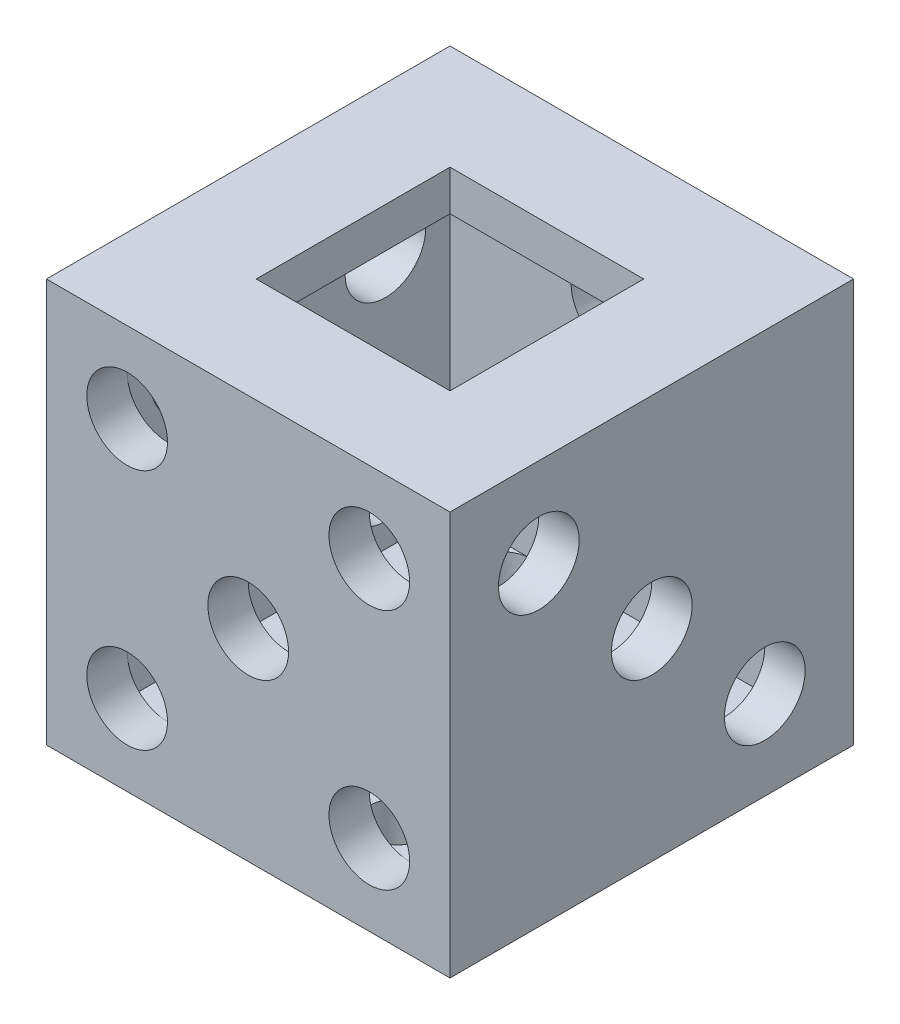
ISO-10303-21;
HEADER;
FILE_DESCRIPTION(('STEP AP214'),'2;1');
FILE_NAME('part.step','',(''),(''),'','','');
FILE_SCHEMA(('AUTOMOTIVE_DESIGN { 1 0 10303 214 1 1 1 1 }'));
ENDSEC;
DATA;
#1=APPLICATION_CONTEXT('core data for automotive mechanical design processes');
#2=APPLICATION_PROTOCOL_DEFINITION('international standard','automotive_design',2000,#1);
#3=PRODUCT_CONTEXT('',#1,'mechanical');
#4=PRODUCT('Part','Part','',(#3));
#5=PRODUCT_RELATED_PRODUCT_CATEGORY('part','',(#4));
#6=PRODUCT_DEFINITION_FORMATION('','',#4);
#7=PRODUCT_DEFINITION_CONTEXT('part definition',#1,'design');
#8=PRODUCT_DEFINITION('design','',#6,#7);
#9=PRODUCT_DEFINITION_SHAPE('','',#8);
#10=(LENGTH_UNIT() NAMED_UNIT(*) SI_UNIT(.MILLI.,.METRE.));
#11=(NAMED_UNIT(*) PLANE_ANGLE_UNIT() SI_UNIT($,.RADIAN.));
#12=(NAMED_UNIT(*) SI_UNIT($,.STERADIAN.) SOLID_ANGLE_UNIT());
#13=UNCERTAINTY_MEASURE_WITH_UNIT(LENGTH_MEASURE(1.E-05),#10,'distance_accuracy_value','');
#14=(GEOMETRIC_REPRESENTATION_CONTEXT(3) GLOBAL_UNCERTAINTY_ASSIGNED_CONTEXT((#13)) GLOBAL_UNIT_ASSIGNED_CONTEXT((#10,
#11,#12)) REPRESENTATION_CONTEXT('',''));
#15=CARTESIAN_POINT('',(0.,0.,0.));
#16=DIRECTION('',(0.,0.,1.));
#17=DIRECTION('',(1.,0.,0.));
#18=AXIS2_PLACEMENT_3D('',#15,#16,#17);
#19=CARTESIAN_POINT('',(-12.5,25.,10.));
#20=DIRECTION('',(0.,0.,-1.));
#21=DIRECTION('',(-1.,0.,0.));
#22=AXIS2_PLACEMENT_3D('',#19,#20,#21);
#23=PLANE('',#22);
#24=CARTESIAN_POINT('',(7.5,5.,10.));
#25=DIRECTION('',(0.,0.,-1.));
#26=DIRECTION('',(-1.,0.,0.));
#27=AXIS2_PLACEMENT_3D('',#24,#25,#26);
#28=CIRCLE('',#27,2.5);
#29=CARTESIAN_POINT('',(10.,5.,10.));
#30=VERTEX_POINT('',#29);
#31=CARTESIAN_POINT('',(7.5,2.5,10.));
#32=VERTEX_POINT('',#31);
#33=EDGE_CURVE('E348',#30,#32,#28,.T.);
#34=ORIENTED_EDGE('',*,*,#33,.F.);
#35=DIRECTION('',(0.,-1.,0.));
#36=VECTOR('',#35,1.);
#37=CARTESIAN_POINT('',(10.,25.,10.));
#38=LINE('',#37,#36);
#39=CARTESIAN_POINT('',(10.,2.5,10.));
#40=VERTEX_POINT('',#39);
#41=EDGE_CURVE('E247',#30,#40,#38,.T.);
#42=ORIENTED_EDGE('',*,*,#41,.T.);
#43=DIRECTION('',(1.,0.,0.));
#44=VECTOR('',#43,1.);
#45=CARTESIAN_POINT('',(-12.5,2.5,10.));
#46=LINE('',#45,#44);
#47=EDGE_CURVE('E223',#32,#40,#46,.T.);
#48=ORIENTED_EDGE('',*,*,#47,.F.);
#49=EDGE_LOOP('',(#34,#42,#48));
#50=FACE_BOUND('',#49,.T.);
#51=ADVANCED_FACE('F39',(#50),#23,.T.);
#52=EDGE_CURVE('E351',#32,#30,#28,.T.);
#53=ORIENTED_EDGE('',*,*,#52,.F.);
#54=CARTESIAN_POINT('',(5.,2.5,10.));
#55=VERTEX_POINT('',#54);
#56=EDGE_CURVE('E639',#55,#32,#46,.T.);
#57=ORIENTED_EDGE('',*,*,#56,.F.);
#58=CARTESIAN_POINT('',(-5.,2.5,10.));
#59=VERTEX_POINT('',#58);
#60=EDGE_CURVE('E224',#59,#55,#46,.T.);
#61=ORIENTED_EDGE('',*,*,#60,.F.);
#62=CARTESIAN_POINT('',(-7.5,2.5,10.));
#63=VERTEX_POINT('',#62);
#64=EDGE_CURVE('E199',#63,#59,#46,.T.);
#65=ORIENTED_EDGE('',*,*,#64,.F.);
#66=CARTESIAN_POINT('',(-7.5,5.,10.));
#67=DIRECTION('',(0.,0.,-1.));
#68=DIRECTION('',(-1.,0.,0.));
#69=AXIS2_PLACEMENT_3D('',#66,#67,#68);
#70=CIRCLE('',#69,2.5);
#71=CARTESIAN_POINT('',(-10.,5.,10.));
#72=VERTEX_POINT('',#71);
#73=EDGE_CURVE('E182',#72,#63,#70,.T.);
#74=ORIENTED_EDGE('',*,*,#73,.F.);
#75=DIRECTION('',(0.,-1.,0.));
#76=VECTOR('',#75,1.);
#77=CARTESIAN_POINT('',(-10.,25.,10.));
#78=LINE('',#77,#76);
#79=CARTESIAN_POINT('',(-10.,20.,10.));
#80=VERTEX_POINT('',#79);
#81=EDGE_CURVE('E196',#80,#72,#78,.T.);
#82=ORIENTED_EDGE('',*,*,#81,.F.);
#83=CARTESIAN_POINT('',(-7.5,20.,10.));
#84=DIRECTION('',(0.,0.,-1.));
#85=DIRECTION('',(-1.,0.,0.));
#86=AXIS2_PLACEMENT_3D('',#83,#84,#85);
#87=CIRCLE('',#86,2.5);
#88=CARTESIAN_POINT('',(-7.5,22.5,10.));
#89=VERTEX_POINT('',#88);
#90=EDGE_CURVE('E202',#89,#80,#87,.T.);
#91=ORIENTED_EDGE('',*,*,#90,.F.);
#92=DIRECTION('',(1.,0.,0.));
#93=VECTOR('',#92,1.);
#94=CARTESIAN_POINT('',(-12.5,22.5,10.));
#95=LINE('',#94,#93);
#96=CARTESIAN_POINT('',(7.5,22.5,10.));
#97=VERTEX_POINT('',#96);
#98=EDGE_CURVE('E510',#89,#97,#95,.T.);
#99=ORIENTED_EDGE('',*,*,#98,.T.);
#100=CARTESIAN_POINT('',(7.5,20.,10.));
#101=DIRECTION('',(0.,0.,-1.));
#102=DIRECTION('',(-1.,0.,0.));
#103=AXIS2_PLACEMENT_3D('',#100,#101,#102);
#104=CIRCLE('',#103,2.5);
#105=CARTESIAN_POINT('',(10.,20.,10.));
#106=VERTEX_POINT('',#105);
#107=EDGE_CURVE('E546',#106,#97,#104,.T.);
#108=ORIENTED_EDGE('',*,*,#107,.F.);
#109=EDGE_CURVE('E246',#106,#30,#38,.T.);
#110=ORIENTED_EDGE('',*,*,#109,.T.);
#111=EDGE_LOOP('',(#53,#57,#61,#65,#74,#82,#91,#99,#108,#110));
#112=FACE_BOUND('',#111,.T.);
#113=CARTESIAN_POINT('',(0.,12.5,10.));
#114=DIRECTION('',(0.,0.,-1.));
#115=DIRECTION('',(-1.,0.,0.));
#116=AXIS2_PLACEMENT_3D('',#113,#114,#115);
#117=CIRCLE('',#116,2.5);
#118=CARTESIAN_POINT('',(-2.5,12.5,10.));
#119=VERTEX_POINT('',#118);
#120=EDGE_CURVE('E617',#119,#119,#117,.T.);
#121=ORIENTED_EDGE('',*,*,#120,.F.);
#122=EDGE_LOOP('',(#121));
#123=FACE_BOUND('',#122,.T.);
#124=ADVANCED_FACE('F193',(#112,#123),#23,.T.);
#125=EDGE_CURVE('E63',#80,#89,#87,.T.);
#126=ORIENTED_EDGE('',*,*,#125,.F.);
#127=CARTESIAN_POINT('',(-10.,22.5,10.));
#128=VERTEX_POINT('',#127);
#129=EDGE_CURVE('E211',#128,#80,#78,.T.);
#130=ORIENTED_EDGE('',*,*,#129,.F.);
#131=EDGE_CURVE('E258',#128,#89,#95,.T.);
#132=ORIENTED_EDGE('',*,*,#131,.T.);
#133=EDGE_LOOP('',(#126,#130,#132));
#134=FACE_BOUND('',#133,.T.);
#135=ADVANCED_FACE('F602',(#134),#23,.T.);
#136=EDGE_CURVE('E56',#97,#106,#104,.T.);
#137=ORIENTED_EDGE('',*,*,#136,.F.);
#138=CARTESIAN_POINT('',(10.,22.5,10.));
#139=VERTEX_POINT('',#138);
#140=EDGE_CURVE('E511',#97,#139,#95,.T.);
#141=ORIENTED_EDGE('',*,*,#140,.T.);
#142=EDGE_CURVE('E242',#139,#106,#38,.T.);
#143=ORIENTED_EDGE('',*,*,#142,.T.);
#144=EDGE_LOOP('',(#137,#141,#143));
#145=FACE_BOUND('',#144,.T.);
#146=ADVANCED_FACE('F605',(#145),#23,.T.);
#147=CARTESIAN_POINT('',(10.,25.,-12.5));
#148=DIRECTION('',(-1.,0.,0.));
#149=DIRECTION('',(0.,0.,1.));
#150=AXIS2_PLACEMENT_3D('',#147,#148,#149);
#151=PLANE('',#150);
#152=ORIENTED_EDGE('',*,*,#41,.F.);
#153=ORIENTED_EDGE('',*,*,#109,.F.);
#154=ORIENTED_EDGE('',*,*,#142,.F.);
#155=DIRECTION('',(0.,0.,-1.));
#156=VECTOR('',#155,1.);
#157=CARTESIAN_POINT('',(10.,22.5,-12.5));
#158=LINE('',#157,#156);
#159=CARTESIAN_POINT('',(10.,22.5,-10.));
#160=VERTEX_POINT('',#159);
#161=EDGE_CURVE('E217',#139,#160,#158,.T.);
#162=ORIENTED_EDGE('',*,*,#161,.T.);
#163=DIRECTION('',(0.,-1.,0.));
#164=VECTOR('',#163,1.);
#165=CARTESIAN_POINT('',(10.,25.,-10.));
#166=LINE('',#165,#164);
#167=CARTESIAN_POINT('',(10.,2.5,-10.));
#168=VERTEX_POINT('',#167);
#169=EDGE_CURVE('E232',#160,#168,#166,.T.);
#170=ORIENTED_EDGE('',*,*,#169,.T.);
#171=DIRECTION('',(0.,0.,-1.));
#172=VECTOR('',#171,1.);
#173=CARTESIAN_POINT('',(10.,2.5,-12.5));
#174=LINE('',#173,#172);
#175=EDGE_CURVE('E248',#40,#168,#174,.T.);
#176=ORIENTED_EDGE('',*,*,#175,.F.);
#177=EDGE_LOOP('',(#152,#153,#154,#162,#170,#176));
#178=FACE_BOUND('',#177,.T.);
#179=CARTESIAN_POINT('',(10.,19.5,7.));
#180=DIRECTION('',(-1.,0.,0.));
#181=DIRECTION('',(0.,0.,1.));
#182=AXIS2_PLACEMENT_3D('',#179,#180,#181);
#183=CIRCLE('',#182,2.5);
#184=CARTESIAN_POINT('',(10.,19.5,9.5));
#185=VERTEX_POINT('',#184);
#186=EDGE_CURVE('E389',#185,#185,#183,.T.);
#187=ORIENTED_EDGE('',*,*,#186,.F.);
#188=EDGE_LOOP('',(#187));
#189=FACE_BOUND('',#188,.T.);
#190=CARTESIAN_POINT('',(10.,12.5,0.));
#191=DIRECTION('',(-1.,0.,0.));
#192=DIRECTION('',(0.,0.,1.));
#193=AXIS2_PLACEMENT_3D('',#190,#191,#192);
#194=CIRCLE('',#193,2.5);
#195=CARTESIAN_POINT('',(10.,12.5,2.5));
#196=VERTEX_POINT('',#195);
#197=EDGE_CURVE('E381',#196,#196,#194,.T.);
#198=ORIENTED_EDGE('',*,*,#197,.F.);
#199=EDGE_LOOP('',(#198));
#200=FACE_BOUND('',#199,.T.);
#201=CARTESIAN_POINT('',(10.,5.5,-7.));
#202=DIRECTION('',(-1.,0.,0.));
#203=DIRECTION('',(0.,0.,1.));
#204=AXIS2_PLACEMENT_3D('',#201,#202,#203);
#205=CIRCLE('',#204,2.5);
#206=CARTESIAN_POINT('',(10.,5.5,-4.5));
#207=VERTEX_POINT('',#206);
#208=EDGE_CURVE('E374',#207,#207,#205,.T.);
#209=ORIENTED_EDGE('',*,*,#208,.F.);
#210=EDGE_LOOP('',(#209));
#211=FACE_BOUND('',#210,.T.);
#212=ADVANCED_FACE('F525',(#178,#189,#200,#211),#151,.T.);
#213=CARTESIAN_POINT('',(-12.5,25.,-10.));
#214=DIRECTION('',(0.,0.,1.));
#215=DIRECTION('',(1.,0.,0.));
#216=AXIS2_PLACEMENT_3D('',#213,#214,#215);
#217=PLANE('',#216);
#218=CARTESIAN_POINT('',(0.,18.5,-10.));
#219=DIRECTION('',(0.,0.,1.));
#220=DIRECTION('',(1.,0.,0.));
#221=AXIS2_PLACEMENT_3D('',#218,#219,#220);
#222=CIRCLE('',#221,2.5);
#223=CARTESIAN_POINT('',(2.5,18.5,-10.));
#224=VERTEX_POINT('',#223);
#225=EDGE_CURVE('E695',#224,#224,#222,.T.);
#226=ORIENTED_EDGE('',*,*,#225,.F.);
#227=EDGE_LOOP('',(#226));
#228=FACE_BOUND('',#227,.T.);
#229=CARTESIAN_POINT('',(0.,6.5,-10.));
#230=DIRECTION('',(0.,0.,1.));
#231=DIRECTION('',(1.,0.,0.));
#232=AXIS2_PLACEMENT_3D('',#229,#230,#231);
#233=CIRCLE('',#232,2.5);
#234=CARTESIAN_POINT('',(2.5,6.5,-10.));
#235=VERTEX_POINT('',#234);
#236=EDGE_CURVE('E703',#235,#235,#233,.T.);
#237=ORIENTED_EDGE('',*,*,#236,.F.);
#238=EDGE_LOOP('',(#237));
#239=FACE_BOUND('',#238,.T.);
#240=DIRECTION('',(-1.,0.,0.));
#241=VECTOR('',#240,1.);
#242=CARTESIAN_POINT('',(-12.5,2.5,-10.));
#243=LINE('',#242,#241);
#244=CARTESIAN_POINT('',(-5.,2.5,-10.));
#245=VERTEX_POINT('',#244);
#246=CARTESIAN_POINT('',(-10.,2.5,-10.));
#247=VERTEX_POINT('',#246);
#248=EDGE_CURVE('E241',#245,#247,#243,.T.);
#249=ORIENTED_EDGE('',*,*,#248,.F.);
#250=CARTESIAN_POINT('',(5.,2.5,-10.));
#251=VERTEX_POINT('',#250);
#252=EDGE_CURVE('E240',#251,#245,#243,.T.);
#253=ORIENTED_EDGE('',*,*,#252,.F.);
#254=EDGE_CURVE('E236',#168,#251,#243,.T.);
#255=ORIENTED_EDGE('',*,*,#254,.F.);
#256=ORIENTED_EDGE('',*,*,#169,.F.);
#257=DIRECTION('',(-1.,0.,0.));
#258=VECTOR('',#257,1.);
#259=CARTESIAN_POINT('',(-12.5,22.5,-10.));
#260=LINE('',#259,#258);
#261=CARTESIAN_POINT('',(-10.,22.5,-10.));
#262=VERTEX_POINT('',#261);
#263=EDGE_CURVE('E514',#160,#262,#260,.T.);
#264=ORIENTED_EDGE('',*,*,#263,.T.);
#265=DIRECTION('',(0.,-1.,0.));
#266=VECTOR('',#265,1.);
#267=CARTESIAN_POINT('',(-10.,25.,-10.));
#268=LINE('',#267,#266);
#269=EDGE_CURVE('E225',#262,#247,#268,.T.);
#270=ORIENTED_EDGE('',*,*,#269,.T.);
#271=EDGE_LOOP('',(#249,#253,#255,#256,#264,#270));
#272=FACE_BOUND('',#271,.T.);
#273=ADVANCED_FACE('F322',(#228,#239,#272),#217,.T.);
#274=CARTESIAN_POINT('',(-10.,25.,-12.5));
#275=DIRECTION('',(1.,0.,0.));
#276=DIRECTION('',(0.,0.,-1.));
#277=AXIS2_PLACEMENT_3D('',#274,#275,#276);
#278=PLANE('',#277);
#279=CARTESIAN_POINT('',(-10.,6.5,6.));
#280=DIRECTION('',(1.,0.,0.));
#281=DIRECTION('',(0.,0.,-1.));
#282=AXIS2_PLACEMENT_3D('',#279,#280,#281);
#283=CIRCLE('',#282,2.5);
#284=CARTESIAN_POINT('',(-10.,5.,4.));
#285=VERTEX_POINT('',#284);
#286=CARTESIAN_POINT('',(-10.,5.,8.00000000000001));
#287=VERTEX_POINT('',#286);
#288=EDGE_CURVE('E329',#285,#287,#283,.T.);
#289=ORIENTED_EDGE('',*,*,#288,.F.);
#290=CARTESIAN_POINT('',(-10.,6.5,6.));
#291=DIRECTION('',(1.,0.,0.));
#292=DIRECTION('',(0.,-0.599999999999999,0.800000000000001));
#293=AXIS2_PLACEMENT_3D('',#290,#291,#292);
#294=CIRCLE('',#293,2.5);
#295=EDGE_CURVE('E269',#287,#285,#294,.T.);
#296=ORIENTED_EDGE('',*,*,#295,.F.);
#297=EDGE_LOOP('',(#289,#296));
#298=FACE_BOUND('',#297,.T.);
#299=ORIENTED_EDGE('',*,*,#81,.T.);
#300=CARTESIAN_POINT('',(-10.,2.5,10.));
#301=VERTEX_POINT('',#300);
#302=EDGE_CURVE('E203',#72,#301,#78,.T.);
#303=ORIENTED_EDGE('',*,*,#302,.T.);
#304=DIRECTION('',(0.,0.,1.));
#305=VECTOR('',#304,1.);
#306=CARTESIAN_POINT('',(-10.,2.5,-12.5));
#307=LINE('',#306,#305);
#308=EDGE_CURVE('E229',#247,#301,#307,.T.);
#309=ORIENTED_EDGE('',*,*,#308,.F.);
#310=ORIENTED_EDGE('',*,*,#269,.F.);
#311=DIRECTION('',(0.,0.,1.));
#312=VECTOR('',#311,1.);
#313=CARTESIAN_POINT('',(-10.,22.5,-12.5));
#314=LINE('',#313,#312);
#315=EDGE_CURVE('E512',#262,#128,#314,.T.);
#316=ORIENTED_EDGE('',*,*,#315,.T.);
#317=ORIENTED_EDGE('',*,*,#129,.T.);
#318=EDGE_LOOP('',(#299,#303,#309,#310,#316,#317));
#319=FACE_BOUND('',#318,.T.);
#320=CARTESIAN_POINT('',(-10.,18.5,6.));
#321=DIRECTION('',(1.,0.,0.));
#322=DIRECTION('',(0.,0.600000000000001,-0.799999999999999));
#323=AXIS2_PLACEMENT_3D('',#320,#321,#322);
#324=CIRCLE('',#323,2.5);
#325=CARTESIAN_POINT('',(-10.,20.,4.00000000000001));
#326=VERTEX_POINT('',#325);
#327=CARTESIAN_POINT('',(-10.,20.,8.));
#328=VERTEX_POINT('',#327);
#329=EDGE_CURVE('E308',#326,#328,#324,.T.);
#330=ORIENTED_EDGE('',*,*,#329,.F.);
#331=CARTESIAN_POINT('',(-10.,18.5,6.));
#332=DIRECTION('',(1.,0.,0.));
#333=DIRECTION('',(0.,0.,-1.));
#334=AXIS2_PLACEMENT_3D('',#331,#332,#333);
#335=CIRCLE('',#334,2.5);
#336=EDGE_CURVE('E312',#328,#326,#335,.T.);
#337=ORIENTED_EDGE('',*,*,#336,.F.);
#338=EDGE_LOOP('',(#330,#337));
#339=FACE_BOUND('',#338,.T.);
#340=CARTESIAN_POINT('',(-10.,6.5,-6.));
#341=DIRECTION('',(1.,0.,0.));
#342=DIRECTION('',(0.,0.,-1.));
#343=AXIS2_PLACEMENT_3D('',#340,#341,#342);
#344=CIRCLE('',#343,2.5);
#345=CARTESIAN_POINT('',(-10.,6.5,-8.5));
#346=VERTEX_POINT('',#345);
#347=EDGE_CURVE('E340',#346,#346,#344,.T.);
#348=ORIENTED_EDGE('',*,*,#347,.F.);
#349=EDGE_LOOP('',(#348));
#350=FACE_BOUND('',#349,.T.);
#351=CARTESIAN_POINT('',(-10.,18.5,-6.));
#352=DIRECTION('',(1.,0.,0.));
#353=DIRECTION('',(0.,0.,-1.));
#354=AXIS2_PLACEMENT_3D('',#351,#352,#353);
#355=CIRCLE('',#354,2.5);
#356=CARTESIAN_POINT('',(-10.,18.5,-8.5));
#357=VERTEX_POINT('',#356);
#358=EDGE_CURVE('E365',#357,#357,#355,.T.);
#359=ORIENTED_EDGE('',*,*,#358,.F.);
#360=EDGE_LOOP('',(#359));
#361=FACE_BOUND('',#360,.T.);
#362=ADVANCED_FACE('F212',(#298,#319,#339,#350,#361),#278,.T.);
#363=EDGE_CURVE('E178',#63,#72,#70,.T.);
#364=ORIENTED_EDGE('',*,*,#363,.F.);
#365=EDGE_CURVE('E205',#301,#63,#46,.T.);
#366=ORIENTED_EDGE('',*,*,#365,.F.);
#367=ORIENTED_EDGE('',*,*,#302,.F.);
#368=EDGE_LOOP('',(#364,#366,#367));
#369=FACE_BOUND('',#368,.T.);
#370=ADVANCED_FACE('F204',(#369),#23,.T.);
#371=CARTESIAN_POINT('',(0.,22.5,0.));
#372=DIRECTION('',(0.,1.,0.));
#373=DIRECTION('',(0.,0.,1.));
#374=AXIS2_PLACEMENT_3D('',#371,#372,#373);
#375=PLANE('',#374);
#376=ORIENTED_EDGE('',*,*,#98,.F.);
#377=ORIENTED_EDGE('',*,*,#131,.F.);
#378=ORIENTED_EDGE('',*,*,#315,.F.);
#379=ORIENTED_EDGE('',*,*,#263,.F.);
#380=ORIENTED_EDGE('',*,*,#161,.F.);
#381=ORIENTED_EDGE('',*,*,#140,.F.);
#382=EDGE_LOOP('',(#376,#377,#378,#379,#380,#381));
#383=FACE_BOUND('',#382,.T.);
#384=DIRECTION('',(1.,0.,0.));
#385=VECTOR('',#384,1.);
#386=CARTESIAN_POINT('',(0.,22.5,6.));
#387=LINE('',#386,#385);
#388=CARTESIAN_POINT('',(-6.,22.5,6.));
#389=VERTEX_POINT('',#388);
#390=CARTESIAN_POINT('',(6.,22.5,6.));
#391=VERTEX_POINT('',#390);
#392=EDGE_CURVE('E49',#389,#391,#387,.T.);
#393=ORIENTED_EDGE('',*,*,#392,.T.);
#394=DIRECTION('',(0.,0.,-1.));
#395=VECTOR('',#394,1.);
#396=CARTESIAN_POINT('',(6.,22.5,0.));
#397=LINE('',#396,#395);
#398=CARTESIAN_POINT('',(6.,22.5,-6.));
#399=VERTEX_POINT('',#398);
#400=EDGE_CURVE('E11',#391,#399,#397,.T.);
#401=ORIENTED_EDGE('',*,*,#400,.T.);
#402=DIRECTION('',(-1.,0.,0.));
#403=VECTOR('',#402,1.);
#404=CARTESIAN_POINT('',(0.,22.5,-6.));
#405=LINE('',#404,#403);
#406=CARTESIAN_POINT('',(-6.,22.5,-6.));
#407=VERTEX_POINT('',#406);
#408=EDGE_CURVE('E253',#399,#407,#405,.T.);
#409=ORIENTED_EDGE('',*,*,#408,.T.);
#410=DIRECTION('',(0.,0.,1.));
#411=VECTOR('',#410,1.);
#412=CARTESIAN_POINT('',(-6.,22.5,0.));
#413=LINE('',#412,#411);
#414=EDGE_CURVE('E257',#407,#389,#413,.T.);
#415=ORIENTED_EDGE('',*,*,#414,.T.);
#416=EDGE_LOOP('',(#393,#401,#409,#415));
#417=FACE_BOUND('',#416,.T.);
#418=ADVANCED_FACE('F604',(#383,#417),#375,.F.);
#419=CARTESIAN_POINT('',(0.,2.5,0.));
#420=DIRECTION('',(0.,1.,0.));
#421=DIRECTION('',(0.,0.,1.));
#422=AXIS2_PLACEMENT_3D('',#419,#420,#421);
#423=PLANE('',#422);
#424=ORIENTED_EDGE('',*,*,#56,.T.);
#425=ORIENTED_EDGE('',*,*,#47,.T.);
#426=ORIENTED_EDGE('',*,*,#175,.T.);
#427=ORIENTED_EDGE('',*,*,#254,.T.);
#428=CARTESIAN_POINT('',(5.,2.5,-8.25));
#429=DIRECTION('',(0.,1.,0.));
#430=DIRECTION('',(0.,0.,1.));
#431=AXIS2_PLACEMENT_3D('',#428,#429,#430);
#432=CIRCLE('',#431,1.75);
#433=EDGE_CURVE('E421',#251,#251,#432,.T.);
#434=ORIENTED_EDGE('',*,*,#433,.F.);
#435=ORIENTED_EDGE('',*,*,#252,.T.);
#436=CARTESIAN_POINT('',(-5.,2.5,-8.25));
#437=DIRECTION('',(0.,1.,0.));
#438=DIRECTION('',(0.,0.,1.));
#439=AXIS2_PLACEMENT_3D('',#436,#437,#438);
#440=CIRCLE('',#439,1.75);
#441=EDGE_CURVE('E431',#245,#245,#440,.T.);
#442=ORIENTED_EDGE('',*,*,#441,.F.);
#443=ORIENTED_EDGE('',*,*,#248,.T.);
#444=ORIENTED_EDGE('',*,*,#308,.T.);
#445=ORIENTED_EDGE('',*,*,#365,.T.);
#446=ORIENTED_EDGE('',*,*,#64,.T.);
#447=CARTESIAN_POINT('',(-5.,2.5,8.25));
#448=DIRECTION('',(0.,1.,0.));
#449=DIRECTION('',(0.,0.,1.));
#450=AXIS2_PLACEMENT_3D('',#447,#448,#449);
#451=CIRCLE('',#450,1.75);
#452=EDGE_CURVE('E417',#59,#59,#451,.T.);
#453=ORIENTED_EDGE('',*,*,#452,.F.);
#454=ORIENTED_EDGE('',*,*,#60,.T.);
#455=CARTESIAN_POINT('',(5.,2.5,8.25));
#456=DIRECTION('',(0.,1.,0.));
#457=DIRECTION('',(0.,0.,1.));
#458=AXIS2_PLACEMENT_3D('',#455,#456,#457);
#459=CIRCLE('',#458,1.75);
#460=EDGE_CURVE('E428',#55,#55,#459,.T.);
#461=ORIENTED_EDGE('',*,*,#460,.F.);
#462=EDGE_LOOP('',(#424,#425,#426,#427,#434,#435,#442,#443,#444,#445,#446,#453,#454,#461));
#463=FACE_BOUND('',#462,.T.);
#464=CARTESIAN_POINT('',(-5.,2.5,0.));
#465=DIRECTION('',(0.,1.,0.));
#466=DIRECTION('',(0.,0.,1.));
#467=AXIS2_PLACEMENT_3D('',#464,#465,#466);
#468=CIRCLE('',#467,1.75);
#469=CARTESIAN_POINT('',(-5.,2.5,1.75));
#470=VERTEX_POINT('',#469);
#471=EDGE_CURVE('E434',#470,#470,#468,.T.);
#472=ORIENTED_EDGE('',*,*,#471,.F.);
#473=EDGE_LOOP('',(#472));
#474=FACE_BOUND('',#473,.T.);
#475=CARTESIAN_POINT('',(5.,2.5,0.));
#476=DIRECTION('',(0.,1.,0.));
#477=DIRECTION('',(0.,0.,1.));
#478=AXIS2_PLACEMENT_3D('',#475,#476,#477);
#479=CIRCLE('',#478,1.75);
#480=CARTESIAN_POINT('',(5.,2.5,1.75));
#481=VERTEX_POINT('',#480);
#482=EDGE_CURVE('E424',#481,#481,#479,.T.);
#483=ORIENTED_EDGE('',*,*,#482,.F.);
#484=EDGE_LOOP('',(#483));
#485=FACE_BOUND('',#484,.T.);
#486=ADVANCED_FACE('F41',(#463,#474,#485),#423,.T.);
#487=CARTESIAN_POINT('',(6.,10.,-6.));
#488=DIRECTION('',(1.,0.,0.));
#489=DIRECTION('',(0.,0.,-1.));
#490=AXIS2_PLACEMENT_3D('',#487,#488,#489);
#491=PLANE('',#490);
#492=DIRECTION('',(0.,1.,0.));
#493=VECTOR('',#492,1.);
#494=CARTESIAN_POINT('',(6.,10.,6.));
#495=LINE('',#494,#493);
#496=CARTESIAN_POINT('',(6.,25.,6.));
#497=VERTEX_POINT('',#496);
#498=EDGE_CURVE('E454',#391,#497,#495,.T.);
#499=ORIENTED_EDGE('',*,*,#498,.T.);
#500=DIRECTION('',(0.,0.,-1.));
#501=VECTOR('',#500,1.);
#502=CARTESIAN_POINT('',(6.,25.,-6.));
#503=LINE('',#502,#501);
#504=CARTESIAN_POINT('',(6.,25.,-6.));
#505=VERTEX_POINT('',#504);
#506=EDGE_CURVE('E438',#497,#505,#503,.T.);
#507=ORIENTED_EDGE('',*,*,#506,.T.);
#508=DIRECTION('',(0.,1.,0.));
#509=VECTOR('',#508,1.);
#510=CARTESIAN_POINT('',(6.,10.,-6.));
#511=LINE('',#510,#509);
#512=EDGE_CURVE('E453',#399,#505,#511,.T.);
#513=ORIENTED_EDGE('',*,*,#512,.F.);
#514=ORIENTED_EDGE('',*,*,#400,.F.);
#515=EDGE_LOOP('',(#499,#507,#513,#514));
#516=FACE_BOUND('',#515,.T.);
#517=ADVANCED_FACE('F863',(#516),#491,.F.);
#518=CARTESIAN_POINT('',(-6.,10.,6.));
#519=DIRECTION('',(0.,0.,1.));
#520=DIRECTION('',(1.,0.,0.));
#521=AXIS2_PLACEMENT_3D('',#518,#519,#520);
#522=PLANE('',#521);
#523=DIRECTION('',(0.,1.,0.));
#524=VECTOR('',#523,1.);
#525=CARTESIAN_POINT('',(-6.,10.,6.));
#526=LINE('',#525,#524);
#527=CARTESIAN_POINT('',(-6.,25.,6.));
#528=VERTEX_POINT('',#527);
#529=EDGE_CURVE('E458',#389,#528,#526,.T.);
#530=ORIENTED_EDGE('',*,*,#529,.T.);
#531=DIRECTION('',(1.,0.,0.));
#532=VECTOR('',#531,1.);
#533=CARTESIAN_POINT('',(-6.,25.,6.));
#534=LINE('',#533,#532);
#535=EDGE_CURVE('E449',#528,#497,#534,.T.);
#536=ORIENTED_EDGE('',*,*,#535,.T.);
#537=ORIENTED_EDGE('',*,*,#498,.F.);
#538=ORIENTED_EDGE('',*,*,#392,.F.);
#539=EDGE_LOOP('',(#530,#536,#537,#538));
#540=FACE_BOUND('',#539,.T.);
#541=ADVANCED_FACE('F853',(#540),#522,.F.);
#542=CARTESIAN_POINT('',(-6.,10.,-6.));
#543=DIRECTION('',(-1.,0.,0.));
#544=DIRECTION('',(0.,0.,1.));
#545=AXIS2_PLACEMENT_3D('',#542,#543,#544);
#546=PLANE('',#545);
#547=DIRECTION('',(0.,1.,0.));
#548=VECTOR('',#547,1.);
#549=CARTESIAN_POINT('',(-6.,10.,-6.));
#550=LINE('',#549,#548);
#551=CARTESIAN_POINT('',(-6.,25.,-6.));
#552=VERTEX_POINT('',#551);
#553=EDGE_CURVE('E461',#407,#552,#550,.T.);
#554=ORIENTED_EDGE('',*,*,#553,.T.);
#555=DIRECTION('',(0.,0.,1.));
#556=VECTOR('',#555,1.);
#557=CARTESIAN_POINT('',(-6.,25.,-6.));
#558=LINE('',#557,#556);
#559=EDGE_CURVE('E445',#552,#528,#558,.T.);
#560=ORIENTED_EDGE('',*,*,#559,.T.);
#561=ORIENTED_EDGE('',*,*,#529,.F.);
#562=ORIENTED_EDGE('',*,*,#414,.F.);
#563=EDGE_LOOP('',(#554,#560,#561,#562));
#564=FACE_BOUND('',#563,.T.);
#565=ADVANCED_FACE('F843',(#564),#546,.F.);
#566=CARTESIAN_POINT('',(-6.,10.,-6.));
#567=DIRECTION('',(0.,0.,-1.));
#568=DIRECTION('',(-1.,0.,0.));
#569=AXIS2_PLACEMENT_3D('',#566,#567,#568);
#570=PLANE('',#569);
#571=ORIENTED_EDGE('',*,*,#512,.T.);
#572=DIRECTION('',(-1.,0.,0.));
#573=VECTOR('',#572,1.);
#574=CARTESIAN_POINT('',(-6.,25.,-6.));
#575=LINE('',#574,#573);
#576=EDGE_CURVE('E441',#505,#552,#575,.T.);
#577=ORIENTED_EDGE('',*,*,#576,.T.);
#578=ORIENTED_EDGE('',*,*,#553,.F.);
#579=ORIENTED_EDGE('',*,*,#408,.F.);
#580=EDGE_LOOP('',(#571,#577,#578,#579));
#581=FACE_BOUND('',#580,.T.);
#582=ADVANCED_FACE('F593',(#581),#570,.F.);
#583=CARTESIAN_POINT('',(12.5,25.,-12.5));
#584=DIRECTION('',(-1.,0.,0.));
#585=DIRECTION('',(0.,0.,1.));
#586=AXIS2_PLACEMENT_3D('',#583,#584,#585);
#587=PLANE('',#586);
#588=CARTESIAN_POINT('',(12.5,12.5,0.));
#589=DIRECTION('',(1.,0.,0.));
#590=DIRECTION('',(0.,0.,-1.));
#591=AXIS2_PLACEMENT_3D('',#588,#589,#590);
#592=CIRCLE('',#591,2.5);
#593=CARTESIAN_POINT('',(12.5,12.5,-2.5));
#594=VERTEX_POINT('',#593);
#595=EDGE_CURVE('E370',#594,#594,#592,.T.);
#596=ORIENTED_EDGE('',*,*,#595,.F.);
#597=EDGE_LOOP('',(#596));
#598=FACE_BOUND('',#597,.T.);
#599=CARTESIAN_POINT('',(12.5,5.5,-7.));
#600=DIRECTION('',(1.,0.,0.));
#601=DIRECTION('',(0.,0.,-1.));
#602=AXIS2_PLACEMENT_3D('',#599,#600,#601);
#603=CIRCLE('',#602,2.5);
#604=CARTESIAN_POINT('',(12.5,5.5,-9.5));
#605=VERTEX_POINT('',#604);
#606=EDGE_CURVE('E369',#605,#605,#603,.T.);
#607=ORIENTED_EDGE('',*,*,#606,.F.);
#608=EDGE_LOOP('',(#607));
#609=FACE_BOUND('',#608,.T.);
#610=CARTESIAN_POINT('',(12.5,19.5,7.));
#611=DIRECTION('',(1.,0.,0.));
#612=DIRECTION('',(0.,0.,-1.));
#613=AXIS2_PLACEMENT_3D('',#610,#611,#612);
#614=CIRCLE('',#613,2.5);
#615=CARTESIAN_POINT('',(12.5,19.5,4.5));
#616=VERTEX_POINT('',#615);
#617=EDGE_CURVE('E385',#616,#616,#614,.T.);
#618=ORIENTED_EDGE('',*,*,#617,.F.);
#619=EDGE_LOOP('',(#618));
#620=FACE_BOUND('',#619,.T.);
#621=DIRECTION('',(0.,0.,-1.));
#622=VECTOR('',#621,1.);
#623=CARTESIAN_POINT('',(12.5,0.,-12.5));
#624=LINE('',#623,#622);
#625=CARTESIAN_POINT('',(12.5,0.,12.5));
#626=VERTEX_POINT('',#625);
#627=CARTESIAN_POINT('',(12.5,0.,-12.5));
#628=VERTEX_POINT('',#627);
#629=EDGE_CURVE('E457',#626,#628,#624,.T.);
#630=ORIENTED_EDGE('',*,*,#629,.T.);
#631=DIRECTION('',(0.,-1.,0.));
#632=VECTOR('',#631,1.);
#633=CARTESIAN_POINT('',(12.5,25.,-12.5));
#634=LINE('',#633,#632);
#635=CARTESIAN_POINT('',(12.5,25.,-12.5));
#636=VERTEX_POINT('',#635);
#637=EDGE_CURVE('E252',#636,#628,#634,.T.);
#638=ORIENTED_EDGE('',*,*,#637,.F.);
#639=DIRECTION('',(0.,0.,-1.));
#640=VECTOR('',#639,1.);
#641=CARTESIAN_POINT('',(12.5,25.,-12.5));
#642=LINE('',#641,#640);
#643=CARTESIAN_POINT('',(12.5,25.,12.5));
#644=VERTEX_POINT('',#643);
#645=EDGE_CURVE('E467',#644,#636,#642,.T.);
#646=ORIENTED_EDGE('',*,*,#645,.F.);
#647=DIRECTION('',(0.,-1.,0.));
#648=VECTOR('',#647,1.);
#649=CARTESIAN_POINT('',(12.5,25.,12.5));
#650=LINE('',#649,#648);
#651=EDGE_CURVE('E481',#644,#626,#650,.T.);
#652=ORIENTED_EDGE('',*,*,#651,.T.);
#653=EDGE_LOOP('',(#630,#638,#646,#652));
#654=FACE_BOUND('',#653,.T.);
#655=ADVANCED_FACE('F582',(#598,#609,#620,#654),#587,.F.);
#656=CARTESIAN_POINT('',(-12.5,25.,-12.5));
#657=DIRECTION('',(0.,0.,1.));
#658=DIRECTION('',(1.,0.,0.));
#659=AXIS2_PLACEMENT_3D('',#656,#657,#658);
#660=PLANE('',#659);
#661=CARTESIAN_POINT('',(0.,18.5,-12.5));
#662=DIRECTION('',(0.,0.,-1.));
#663=DIRECTION('',(-1.,0.,0.));
#664=AXIS2_PLACEMENT_3D('',#661,#662,#663);
#665=CIRCLE('',#664,2.5);
#666=CARTESIAN_POINT('',(-2.5,18.5,-12.5));
#667=VERTEX_POINT('',#666);
#668=EDGE_CURVE('E707',#667,#667,#665,.T.);
#669=ORIENTED_EDGE('',*,*,#668,.F.);
#670=EDGE_LOOP('',(#669));
#671=FACE_BOUND('',#670,.T.);
#672=CARTESIAN_POINT('',(0.,6.5,-12.5));
#673=DIRECTION('',(0.,0.,-1.));
#674=DIRECTION('',(-1.,0.,0.));
#675=AXIS2_PLACEMENT_3D('',#672,#673,#674);
#676=CIRCLE('',#675,2.5);
#677=CARTESIAN_POINT('',(-2.5,6.5,-12.5));
#678=VERTEX_POINT('',#677);
#679=EDGE_CURVE('E708',#678,#678,#676,.T.);
#680=ORIENTED_EDGE('',*,*,#679,.F.);
#681=EDGE_LOOP('',(#680));
#682=FACE_BOUND('',#681,.T.);
#683=DIRECTION('',(-1.,0.,0.));
#684=VECTOR('',#683,1.);
#685=CARTESIAN_POINT('',(-12.5,0.,-12.5));
#686=LINE('',#685,#684);
#687=CARTESIAN_POINT('',(-12.5,0.,-12.5));
#688=VERTEX_POINT('',#687);
#689=EDGE_CURVE('E485',#628,#688,#686,.T.);
#690=ORIENTED_EDGE('',*,*,#689,.T.);
#691=DIRECTION('',(0.,-1.,0.));
#692=VECTOR('',#691,1.);
#693=CARTESIAN_POINT('',(-12.5,25.,-12.5));
#694=LINE('',#693,#692);
#695=CARTESIAN_POINT('',(-12.5,25.,-12.5));
#696=VERTEX_POINT('',#695);
#697=EDGE_CURVE('E500',#696,#688,#694,.T.);
#698=ORIENTED_EDGE('',*,*,#697,.F.);
#699=DIRECTION('',(-1.,0.,0.));
#700=VECTOR('',#699,1.);
#701=CARTESIAN_POINT('',(-12.5,25.,-12.5));
#702=LINE('',#701,#700);
#703=EDGE_CURVE('E471',#636,#696,#702,.T.);
#704=ORIENTED_EDGE('',*,*,#703,.F.);
#705=ORIENTED_EDGE('',*,*,#637,.T.);
#706=EDGE_LOOP('',(#690,#698,#704,#705));
#707=FACE_BOUND('',#706,.T.);
#708=ADVANCED_FACE('F566',(#671,#682,#707),#660,.F.);
#709=CARTESIAN_POINT('',(-12.5,25.,-12.5));
#710=DIRECTION('',(1.,0.,0.));
#711=DIRECTION('',(0.,0.,-1.));
#712=AXIS2_PLACEMENT_3D('',#709,#710,#711);
#713=PLANE('',#712);
#714=CARTESIAN_POINT('',(-12.5,6.5,-6.));
#715=DIRECTION('',(-1.,0.,0.));
#716=DIRECTION('',(0.,0.,1.));
#717=AXIS2_PLACEMENT_3D('',#714,#715,#716);
#718=CIRCLE('',#717,2.5);
#719=CARTESIAN_POINT('',(-12.5,6.5,-3.5));
#720=VERTEX_POINT('',#719);
#721=EDGE_CURVE('E336',#720,#720,#718,.T.);
#722=ORIENTED_EDGE('',*,*,#721,.F.);
#723=EDGE_LOOP('',(#722));
#724=FACE_BOUND('',#723,.T.);
#725=CARTESIAN_POINT('',(-12.5,6.5,6.));
#726=DIRECTION('',(-1.,0.,0.));
#727=DIRECTION('',(0.,0.,1.));
#728=AXIS2_PLACEMENT_3D('',#725,#726,#727);
#729=CIRCLE('',#728,2.5);
#730=CARTESIAN_POINT('',(-12.5,6.5,8.5));
#731=VERTEX_POINT('',#730);
#732=EDGE_CURVE('E342',#731,#731,#729,.T.);
#733=ORIENTED_EDGE('',*,*,#732,.F.);
#734=EDGE_LOOP('',(#733));
#735=FACE_BOUND('',#734,.T.);
#736=CARTESIAN_POINT('',(-12.5,18.5,6.));
#737=DIRECTION('',(-1.,0.,0.));
#738=DIRECTION('',(0.,0.,1.));
#739=AXIS2_PLACEMENT_3D('',#736,#737,#738);
#740=CIRCLE('',#739,2.5);
#741=CARTESIAN_POINT('',(-12.5,18.5,8.5));
#742=VERTEX_POINT('',#741);
#743=EDGE_CURVE('E357',#742,#742,#740,.T.);
#744=ORIENTED_EDGE('',*,*,#743,.F.);
#745=EDGE_LOOP('',(#744));
#746=FACE_BOUND('',#745,.T.);
#747=CARTESIAN_POINT('',(-12.5,18.5,-6.));
#748=DIRECTION('',(-1.,0.,0.));
#749=DIRECTION('',(0.,0.,1.));
#750=AXIS2_PLACEMENT_3D('',#747,#748,#749);
#751=CIRCLE('',#750,2.5);
#752=CARTESIAN_POINT('',(-12.5,18.5,-3.5));
#753=VERTEX_POINT('',#752);
#754=EDGE_CURVE('E361',#753,#753,#751,.T.);
#755=ORIENTED_EDGE('',*,*,#754,.F.);
#756=EDGE_LOOP('',(#755));
#757=FACE_BOUND('',#756,.T.);
#758=DIRECTION('',(0.,0.,1.));
#759=VECTOR('',#758,1.);
#760=CARTESIAN_POINT('',(-12.5,0.,-12.5));
#761=LINE('',#760,#759);
#762=CARTESIAN_POINT('',(-12.5,0.,12.5));
#763=VERTEX_POINT('',#762);
#764=EDGE_CURVE('E488',#688,#763,#761,.T.);
#765=ORIENTED_EDGE('',*,*,#764,.T.);
#766=DIRECTION('',(0.,-1.,0.));
#767=VECTOR('',#766,1.);
#768=CARTESIAN_POINT('',(-12.5,25.,12.5));
#769=LINE('',#768,#767);
#770=CARTESIAN_POINT('',(-12.5,25.,12.5));
#771=VERTEX_POINT('',#770);
#772=EDGE_CURVE('E496',#771,#763,#769,.T.);
#773=ORIENTED_EDGE('',*,*,#772,.F.);
#774=DIRECTION('',(0.,0.,1.));
#775=VECTOR('',#774,1.);
#776=CARTESIAN_POINT('',(-12.5,25.,-12.5));
#777=LINE('',#776,#775);
#778=EDGE_CURVE('E475',#696,#771,#777,.T.);
#779=ORIENTED_EDGE('',*,*,#778,.F.);
#780=ORIENTED_EDGE('',*,*,#697,.T.);
#781=EDGE_LOOP('',(#765,#773,#779,#780));
#782=FACE_BOUND('',#781,.T.);
#783=ADVANCED_FACE('F562',(#724,#735,#746,#757,#782),#713,.F.);
#784=CARTESIAN_POINT('',(-12.5,25.,12.5));
#785=DIRECTION('',(0.,0.,-1.));
#786=DIRECTION('',(-1.,0.,0.));
#787=AXIS2_PLACEMENT_3D('',#784,#785,#786);
#788=PLANE('',#787);
#789=CARTESIAN_POINT('',(7.5,5.,12.5));
#790=DIRECTION('',(0.,0.,1.));
#791=DIRECTION('',(1.,0.,0.));
#792=AXIS2_PLACEMENT_3D('',#789,#790,#791);
#793=CIRCLE('',#792,2.5);
#794=CARTESIAN_POINT('',(10.,5.,12.5));
#795=VERTEX_POINT('',#794);
#796=EDGE_CURVE('E673',#795,#795,#793,.T.);
#797=ORIENTED_EDGE('',*,*,#796,.F.);
#798=EDGE_LOOP('',(#797));
#799=FACE_BOUND('',#798,.T.);
#800=CARTESIAN_POINT('',(-7.5,5.,12.5));
#801=DIRECTION('',(0.,0.,1.));
#802=DIRECTION('',(1.,0.,0.));
#803=AXIS2_PLACEMENT_3D('',#800,#801,#802);
#804=CIRCLE('',#803,2.5);
#805=CARTESIAN_POINT('',(-5.,5.,12.5));
#806=VERTEX_POINT('',#805);
#807=EDGE_CURVE('E677',#806,#806,#804,.T.);
#808=ORIENTED_EDGE('',*,*,#807,.F.);
#809=EDGE_LOOP('',(#808));
#810=FACE_BOUND('',#809,.T.);
#811=CARTESIAN_POINT('',(-7.5,20.,12.5));
#812=DIRECTION('',(0.,0.,1.));
#813=DIRECTION('',(1.,0.,0.));
#814=AXIS2_PLACEMENT_3D('',#811,#812,#813);
#815=CIRCLE('',#814,2.5);
#816=CARTESIAN_POINT('',(-5.,20.,12.5));
#817=VERTEX_POINT('',#816);
#818=EDGE_CURVE('E681',#817,#817,#815,.T.);
#819=ORIENTED_EDGE('',*,*,#818,.F.);
#820=EDGE_LOOP('',(#819));
#821=FACE_BOUND('',#820,.T.);
#822=CARTESIAN_POINT('',(7.5,20.,12.5));
#823=DIRECTION('',(0.,0.,1.));
#824=DIRECTION('',(1.,0.,0.));
#825=AXIS2_PLACEMENT_3D('',#822,#823,#824);
#826=CIRCLE('',#825,2.5);
#827=CARTESIAN_POINT('',(10.,20.,12.5));
#828=VERTEX_POINT('',#827);
#829=EDGE_CURVE('E685',#828,#828,#826,.T.);
#830=ORIENTED_EDGE('',*,*,#829,.F.);
#831=EDGE_LOOP('',(#830));
#832=FACE_BOUND('',#831,.T.);
#833=CARTESIAN_POINT('',(0.,12.5,12.5));
#834=DIRECTION('',(0.,0.,1.));
#835=DIRECTION('',(1.,0.,0.));
#836=AXIS2_PLACEMENT_3D('',#833,#834,#835);
#837=CIRCLE('',#836,2.5);
#838=CARTESIAN_POINT('',(2.5,12.5,12.5));
#839=VERTEX_POINT('',#838);
#840=EDGE_CURVE('E188',#839,#839,#837,.T.);
#841=ORIENTED_EDGE('',*,*,#840,.F.);
#842=EDGE_LOOP('',(#841));
#843=FACE_BOUND('',#842,.T.);
#844=DIRECTION('',(1.,0.,0.));
#845=VECTOR('',#844,1.);
#846=CARTESIAN_POINT('',(-12.5,0.,12.5));
#847=LINE('',#846,#845);
#848=EDGE_CURVE('E472',#763,#626,#847,.T.);
#849=ORIENTED_EDGE('',*,*,#848,.T.);
#850=ORIENTED_EDGE('',*,*,#651,.F.);
#851=DIRECTION('',(1.,0.,0.));
#852=VECTOR('',#851,1.);
#853=CARTESIAN_POINT('',(-12.5,25.,12.5));
#854=LINE('',#853,#852);
#855=EDGE_CURVE('E478',#771,#644,#854,.T.);
#856=ORIENTED_EDGE('',*,*,#855,.F.);
#857=ORIENTED_EDGE('',*,*,#772,.T.);
#858=EDGE_LOOP('',(#849,#850,#856,#857));
#859=FACE_BOUND('',#858,.T.);
#860=ADVANCED_FACE('F565',(#799,#810,#821,#832,#843,#859),#788,.F.);
#861=CARTESIAN_POINT('',(0.,25.,0.));
#862=DIRECTION('',(0.,1.,0.));
#863=DIRECTION('',(0.,0.,1.));
#864=AXIS2_PLACEMENT_3D('',#861,#862,#863);
#865=PLANE('',#864);
#866=ORIENTED_EDGE('',*,*,#506,.F.);
#867=ORIENTED_EDGE('',*,*,#535,.F.);
#868=ORIENTED_EDGE('',*,*,#559,.F.);
#869=ORIENTED_EDGE('',*,*,#576,.F.);
#870=EDGE_LOOP('',(#866,#867,#868,#869));
#871=FACE_BOUND('',#870,.T.);
#872=ORIENTED_EDGE('',*,*,#645,.T.);
#873=ORIENTED_EDGE('',*,*,#703,.T.);
#874=ORIENTED_EDGE('',*,*,#778,.T.);
#875=ORIENTED_EDGE('',*,*,#855,.T.);
#876=EDGE_LOOP('',(#872,#873,#874,#875));
#877=FACE_BOUND('',#876,.T.);
#878=ADVANCED_FACE('F585',(#871,#877),#865,.T.);
#879=CARTESIAN_POINT('',(0.,0.,0.));
#880=DIRECTION('',(0.,1.,0.));
#881=DIRECTION('',(0.,0.,1.));
#882=AXIS2_PLACEMENT_3D('',#879,#880,#881);
#883=PLANE('',#882);
#884=CARTESIAN_POINT('',(-5.,0.,0.));
#885=DIRECTION('',(0.,-1.,0.));
#886=DIRECTION('',(0.,0.,-1.));
#887=AXIS2_PLACEMENT_3D('',#884,#885,#886);
#888=CIRCLE('',#887,1.75);
#889=CARTESIAN_POINT('',(-5.,0.,-1.75));
#890=VERTEX_POINT('',#889);
#891=EDGE_CURVE('E398',#890,#890,#888,.T.);
#892=ORIENTED_EDGE('',*,*,#891,.F.);
#893=EDGE_LOOP('',(#892));
#894=FACE_BOUND('',#893,.T.);
#895=CARTESIAN_POINT('',(-5.,0.,-8.25));
#896=DIRECTION('',(0.,-1.,0.));
#897=DIRECTION('',(0.,0.,-1.));
#898=AXIS2_PLACEMENT_3D('',#895,#896,#897);
#899=CIRCLE('',#898,1.75);
#900=CARTESIAN_POINT('',(-5.,0.,-10.));
#901=VERTEX_POINT('',#900);
#902=EDGE_CURVE('E403',#901,#901,#899,.T.);
#903=ORIENTED_EDGE('',*,*,#902,.F.);
#904=EDGE_LOOP('',(#903));
#905=FACE_BOUND('',#904,.T.);
#906=CARTESIAN_POINT('',(5.,0.,8.25));
#907=DIRECTION('',(0.,-1.,0.));
#908=DIRECTION('',(0.,0.,-1.));
#909=AXIS2_PLACEMENT_3D('',#906,#907,#908);
#910=CIRCLE('',#909,1.75);
#911=CARTESIAN_POINT('',(5.,0.,6.5));
#912=VERTEX_POINT('',#911);
#913=EDGE_CURVE('E407',#912,#912,#910,.T.);
#914=ORIENTED_EDGE('',*,*,#913,.F.);
#915=EDGE_LOOP('',(#914));
#916=FACE_BOUND('',#915,.T.);
#917=CARTESIAN_POINT('',(5.,0.,0.));
#918=DIRECTION('',(0.,-1.,0.));
#919=DIRECTION('',(0.,0.,-1.));
#920=AXIS2_PLACEMENT_3D('',#917,#918,#919);
#921=CIRCLE('',#920,1.75);
#922=CARTESIAN_POINT('',(5.,0.,-1.75));
#923=VERTEX_POINT('',#922);
#924=EDGE_CURVE('E397',#923,#923,#921,.T.);
#925=ORIENTED_EDGE('',*,*,#924,.F.);
#926=EDGE_LOOP('',(#925));
#927=FACE_BOUND('',#926,.T.);
#928=CARTESIAN_POINT('',(5.,0.,-8.25));
#929=DIRECTION('',(0.,-1.,0.));
#930=DIRECTION('',(0.,0.,-1.));
#931=AXIS2_PLACEMENT_3D('',#928,#929,#930);
#932=CIRCLE('',#931,1.75);
#933=CARTESIAN_POINT('',(5.,0.,-10.));
#934=VERTEX_POINT('',#933);
#935=EDGE_CURVE('E393',#934,#934,#932,.T.);
#936=ORIENTED_EDGE('',*,*,#935,.F.);
#937=EDGE_LOOP('',(#936));
#938=FACE_BOUND('',#937,.T.);
#939=CARTESIAN_POINT('',(-5.,0.,8.25));
#940=DIRECTION('',(0.,-1.,0.));
#941=DIRECTION('',(0.,0.,-1.));
#942=AXIS2_PLACEMENT_3D('',#939,#940,#941);
#943=CIRCLE('',#942,1.75);
#944=CARTESIAN_POINT('',(-5.,0.,6.5));
#945=VERTEX_POINT('',#944);
#946=EDGE_CURVE('E402',#945,#945,#943,.T.);
#947=ORIENTED_EDGE('',*,*,#946,.F.);
#948=EDGE_LOOP('',(#947));
#949=FACE_BOUND('',#948,.T.);
#950=ORIENTED_EDGE('',*,*,#629,.F.);
#951=ORIENTED_EDGE('',*,*,#848,.F.);
#952=ORIENTED_EDGE('',*,*,#764,.F.);
#953=ORIENTED_EDGE('',*,*,#689,.F.);
#954=EDGE_LOOP('',(#950,#951,#952,#953));
#955=FACE_BOUND('',#954,.T.);
#956=ADVANCED_FACE('F579',(#894,#905,#916,#927,#938,#949,#955),#883,.F.);
#957=CARTESIAN_POINT('',(-5.,15.,8.25));
#958=DIRECTION('',(0.,-1.,0.));
#959=DIRECTION('',(0.,0.,-1.));
#960=AXIS2_PLACEMENT_3D('',#957,#958,#959);
#961=CYLINDRICAL_SURFACE('',#960,1.75);
#962=ORIENTED_EDGE('',*,*,#452,.T.);
#963=EDGE_LOOP('',(#962));
#964=FACE_BOUND('',#963,.T.);
#965=ORIENTED_EDGE('',*,*,#946,.T.);
#966=EDGE_LOOP('',(#965));
#967=FACE_BOUND('',#966,.T.);
#968=ADVANCED_FACE('F647',(#964,#967),#961,.F.);
#969=CARTESIAN_POINT('',(5.,15.,-8.25));
#970=DIRECTION('',(0.,-1.,0.));
#971=DIRECTION('',(0.,0.,-1.));
#972=AXIS2_PLACEMENT_3D('',#969,#970,#971);
#973=CYLINDRICAL_SURFACE('',#972,1.75);
#974=ORIENTED_EDGE('',*,*,#433,.T.);
#975=EDGE_LOOP('',(#974));
#976=FACE_BOUND('',#975,.T.);
#977=ORIENTED_EDGE('',*,*,#935,.T.);
#978=EDGE_LOOP('',(#977));
#979=FACE_BOUND('',#978,.T.);
#980=ADVANCED_FACE('F650',(#976,#979),#973,.F.);
#981=CARTESIAN_POINT('',(5.,15.,0.));
#982=DIRECTION('',(0.,-1.,0.));
#983=DIRECTION('',(0.,0.,-1.));
#984=AXIS2_PLACEMENT_3D('',#981,#982,#983);
#985=CYLINDRICAL_SURFACE('',#984,1.75);
#986=ORIENTED_EDGE('',*,*,#482,.T.);
#987=EDGE_LOOP('',(#986));
#988=FACE_BOUND('',#987,.T.);
#989=ORIENTED_EDGE('',*,*,#924,.T.);
#990=EDGE_LOOP('',(#989));
#991=FACE_BOUND('',#990,.T.);
#992=ADVANCED_FACE('F802',(#988,#991),#985,.F.);
#993=CARTESIAN_POINT('',(5.,15.,8.25));
#994=DIRECTION('',(0.,-1.,0.));
#995=DIRECTION('',(0.,0.,-1.));
#996=AXIS2_PLACEMENT_3D('',#993,#994,#995);
#997=CYLINDRICAL_SURFACE('',#996,1.75);
#998=ORIENTED_EDGE('',*,*,#460,.T.);
#999=EDGE_LOOP('',(#998));
#1000=FACE_BOUND('',#999,.T.);
#1001=ORIENTED_EDGE('',*,*,#913,.T.);
#1002=EDGE_LOOP('',(#1001));
#1003=FACE_BOUND('',#1002,.T.);
#1004=ADVANCED_FACE('F794',(#1000,#1003),#997,.F.);
#1005=CARTESIAN_POINT('',(-5.,15.,-8.25));
#1006=DIRECTION('',(0.,-1.,0.));
#1007=DIRECTION('',(0.,0.,-1.));
#1008=AXIS2_PLACEMENT_3D('',#1005,#1006,#1007);
#1009=CYLINDRICAL_SURFACE('',#1008,1.75);
#1010=ORIENTED_EDGE('',*,*,#441,.T.);
#1011=EDGE_LOOP('',(#1010));
#1012=FACE_BOUND('',#1011,.T.);
#1013=ORIENTED_EDGE('',*,*,#902,.T.);
#1014=EDGE_LOOP('',(#1013));
#1015=FACE_BOUND('',#1014,.T.);
#1016=ADVANCED_FACE('F786',(#1012,#1015),#1009,.F.);
#1017=CARTESIAN_POINT('',(-5.,15.,0.));
#1018=DIRECTION('',(0.,-1.,0.));
#1019=DIRECTION('',(0.,0.,-1.));
#1020=AXIS2_PLACEMENT_3D('',#1017,#1018,#1019);
#1021=CYLINDRICAL_SURFACE('',#1020,1.75);
#1022=ORIENTED_EDGE('',*,*,#471,.T.);
#1023=EDGE_LOOP('',(#1022));
#1024=FACE_BOUND('',#1023,.T.);
#1025=ORIENTED_EDGE('',*,*,#891,.T.);
#1026=EDGE_LOOP('',(#1025));
#1027=FACE_BOUND('',#1026,.T.);
#1028=ADVANCED_FACE('F778',(#1024,#1027),#1021,.F.);
#1029=CARTESIAN_POINT('',(-2.5,19.5,7.));
#1030=DIRECTION('',(1.,0.,0.));
#1031=DIRECTION('',(0.,0.,-1.));
#1032=AXIS2_PLACEMENT_3D('',#1029,#1030,#1031);
#1033=CYLINDRICAL_SURFACE('',#1032,2.5);
#1034=ORIENTED_EDGE('',*,*,#186,.T.);
#1035=EDGE_LOOP('',(#1034));
#1036=FACE_BOUND('',#1035,.T.);
#1037=ORIENTED_EDGE('',*,*,#617,.T.);
#1038=EDGE_LOOP('',(#1037));
#1039=FACE_BOUND('',#1038,.T.);
#1040=ADVANCED_FACE('F770',(#1036,#1039),#1033,.F.);
#1041=CARTESIAN_POINT('',(-2.5,5.5,-7.));
#1042=DIRECTION('',(1.,0.,0.));
#1043=DIRECTION('',(0.,0.,-1.));
#1044=AXIS2_PLACEMENT_3D('',#1041,#1042,#1043);
#1045=CYLINDRICAL_SURFACE('',#1044,2.5);
#1046=ORIENTED_EDGE('',*,*,#208,.T.);
#1047=EDGE_LOOP('',(#1046));
#1048=FACE_BOUND('',#1047,.T.);
#1049=ORIENTED_EDGE('',*,*,#606,.T.);
#1050=EDGE_LOOP('',(#1049));
#1051=FACE_BOUND('',#1050,.T.);
#1052=ADVANCED_FACE('F763',(#1048,#1051),#1045,.F.);
#1053=CARTESIAN_POINT('',(-2.5,12.5,0.));
#1054=DIRECTION('',(1.,0.,0.));
#1055=DIRECTION('',(0.,0.,-1.));
#1056=AXIS2_PLACEMENT_3D('',#1053,#1054,#1055);
#1057=CYLINDRICAL_SURFACE('',#1056,2.5);
#1058=ORIENTED_EDGE('',*,*,#197,.T.);
#1059=EDGE_LOOP('',(#1058));
#1060=FACE_BOUND('',#1059,.T.);
#1061=ORIENTED_EDGE('',*,*,#595,.T.);
#1062=EDGE_LOOP('',(#1061));
#1063=FACE_BOUND('',#1062,.T.);
#1064=ADVANCED_FACE('F559',(#1060,#1063),#1057,.F.);
#1065=CARTESIAN_POINT('',(2.5,18.5,-6.));
#1066=DIRECTION('',(-1.,0.,0.));
#1067=DIRECTION('',(0.,0.,1.));
#1068=AXIS2_PLACEMENT_3D('',#1065,#1066,#1067);
#1069=CYLINDRICAL_SURFACE('',#1068,2.5);
#1070=ORIENTED_EDGE('',*,*,#358,.T.);
#1071=EDGE_LOOP('',(#1070));
#1072=FACE_BOUND('',#1071,.T.);
#1073=ORIENTED_EDGE('',*,*,#754,.T.);
#1074=EDGE_LOOP('',(#1073));
#1075=FACE_BOUND('',#1074,.T.);
#1076=ADVANCED_FACE('F291',(#1072,#1075),#1069,.F.);
#1077=CARTESIAN_POINT('',(2.5,18.5,6.));
#1078=DIRECTION('',(-1.,0.,0.));
#1079=DIRECTION('',(0.,0.,1.));
#1080=AXIS2_PLACEMENT_3D('',#1077,#1078,#1079);
#1081=CYLINDRICAL_SURFACE('',#1080,2.5);
#1082=ORIENTED_EDGE('',*,*,#329,.T.);
#1083=ORIENTED_EDGE('',*,*,#336,.T.);
#1084=EDGE_LOOP('',(#1082,#1083));
#1085=FACE_BOUND('',#1084,.T.);
#1086=ORIENTED_EDGE('',*,*,#743,.T.);
#1087=EDGE_LOOP('',(#1086));
#1088=FACE_BOUND('',#1087,.T.);
#1089=ADVANCED_FACE('F286',(#1085,#1088),#1081,.F.);
#1090=CARTESIAN_POINT('',(2.5,6.5,6.));
#1091=DIRECTION('',(-1.,0.,0.));
#1092=DIRECTION('',(0.,0.,1.));
#1093=AXIS2_PLACEMENT_3D('',#1090,#1091,#1092);
#1094=CYLINDRICAL_SURFACE('',#1093,2.5);
#1095=ORIENTED_EDGE('',*,*,#295,.T.);
#1096=ORIENTED_EDGE('',*,*,#288,.T.);
#1097=EDGE_LOOP('',(#1095,#1096));
#1098=FACE_BOUND('',#1097,.T.);
#1099=ORIENTED_EDGE('',*,*,#732,.T.);
#1100=EDGE_LOOP('',(#1099));
#1101=FACE_BOUND('',#1100,.T.);
#1102=ADVANCED_FACE('F275',(#1098,#1101),#1094,.F.);
#1103=CARTESIAN_POINT('',(2.5,6.5,-6.));
#1104=DIRECTION('',(-1.,0.,0.));
#1105=DIRECTION('',(0.,0.,1.));
#1106=AXIS2_PLACEMENT_3D('',#1103,#1104,#1105);
#1107=CYLINDRICAL_SURFACE('',#1106,2.5);
#1108=ORIENTED_EDGE('',*,*,#347,.T.);
#1109=EDGE_LOOP('',(#1108));
#1110=FACE_BOUND('',#1109,.T.);
#1111=ORIENTED_EDGE('',*,*,#721,.T.);
#1112=EDGE_LOOP('',(#1111));
#1113=FACE_BOUND('',#1112,.T.);
#1114=ADVANCED_FACE('F285',(#1110,#1113),#1107,.F.);
#1115=CARTESIAN_POINT('',(0.,12.5,-2.5));
#1116=DIRECTION('',(0.,0.,1.));
#1117=DIRECTION('',(1.,0.,0.));
#1118=AXIS2_PLACEMENT_3D('',#1115,#1116,#1117);
#1119=CYLINDRICAL_SURFACE('',#1118,2.5);
#1120=ORIENTED_EDGE('',*,*,#120,.T.);
#1121=EDGE_LOOP('',(#1120));
#1122=FACE_BOUND('',#1121,.T.);
#1123=ORIENTED_EDGE('',*,*,#840,.T.);
#1124=EDGE_LOOP('',(#1123));
#1125=FACE_BOUND('',#1124,.T.);
#1126=ADVANCED_FACE('F730',(#1122,#1125),#1119,.F.);
#1127=CARTESIAN_POINT('',(7.5,20.,-2.5));
#1128=DIRECTION('',(0.,0.,1.));
#1129=DIRECTION('',(1.,0.,0.));
#1130=AXIS2_PLACEMENT_3D('',#1127,#1128,#1129);
#1131=CYLINDRICAL_SURFACE('',#1130,2.5);
#1132=ORIENTED_EDGE('',*,*,#136,.T.);
#1133=ORIENTED_EDGE('',*,*,#107,.T.);
#1134=EDGE_LOOP('',(#1132,#1133));
#1135=FACE_BOUND('',#1134,.T.);
#1136=ORIENTED_EDGE('',*,*,#829,.T.);
#1137=EDGE_LOOP('',(#1136));
#1138=FACE_BOUND('',#1137,.T.);
#1139=ADVANCED_FACE('F726',(#1135,#1138),#1131,.F.);
#1140=CARTESIAN_POINT('',(-7.5,20.,-2.5));
#1141=DIRECTION('',(0.,0.,1.));
#1142=DIRECTION('',(1.,0.,0.));
#1143=AXIS2_PLACEMENT_3D('',#1140,#1141,#1142);
#1144=CYLINDRICAL_SURFACE('',#1143,2.5);
#1145=ORIENTED_EDGE('',*,*,#125,.T.);
#1146=ORIENTED_EDGE('',*,*,#90,.T.);
#1147=EDGE_LOOP('',(#1145,#1146));
#1148=FACE_BOUND('',#1147,.T.);
#1149=ORIENTED_EDGE('',*,*,#818,.T.);
#1150=EDGE_LOOP('',(#1149));
#1151=FACE_BOUND('',#1150,.T.);
#1152=ADVANCED_FACE('F729',(#1148,#1151),#1144,.F.);
#1153=CARTESIAN_POINT('',(-7.5,5.,-2.5));
#1154=DIRECTION('',(0.,0.,1.));
#1155=DIRECTION('',(1.,0.,0.));
#1156=AXIS2_PLACEMENT_3D('',#1153,#1154,#1155);
#1157=CYLINDRICAL_SURFACE('',#1156,2.5);
#1158=ORIENTED_EDGE('',*,*,#73,.T.);
#1159=ORIENTED_EDGE('',*,*,#363,.T.);
#1160=EDGE_LOOP('',(#1158,#1159));
#1161=FACE_BOUND('',#1160,.T.);
#1162=ORIENTED_EDGE('',*,*,#807,.T.);
#1163=EDGE_LOOP('',(#1162));
#1164=FACE_BOUND('',#1163,.T.);
#1165=ADVANCED_FACE('F180',(#1161,#1164),#1157,.F.);
#1166=CARTESIAN_POINT('',(7.5,5.,-2.5));
#1167=DIRECTION('',(0.,0.,1.));
#1168=DIRECTION('',(1.,0.,0.));
#1169=AXIS2_PLACEMENT_3D('',#1166,#1167,#1168);
#1170=CYLINDRICAL_SURFACE('',#1169,2.5);
#1171=ORIENTED_EDGE('',*,*,#33,.T.);
#1172=ORIENTED_EDGE('',*,*,#52,.T.);
#1173=EDGE_LOOP('',(#1171,#1172));
#1174=FACE_BOUND('',#1173,.T.);
#1175=ORIENTED_EDGE('',*,*,#796,.T.);
#1176=EDGE_LOOP('',(#1175));
#1177=FACE_BOUND('',#1176,.T.);
#1178=ADVANCED_FACE('F636',(#1174,#1177),#1170,.F.);
#1179=CARTESIAN_POINT('',(0.,6.5,-2.5));
#1180=DIRECTION('',(0.,0.,-1.));
#1181=DIRECTION('',(-1.,0.,0.));
#1182=AXIS2_PLACEMENT_3D('',#1179,#1180,#1181);
#1183=CYLINDRICAL_SURFACE('',#1182,2.5);
#1184=ORIENTED_EDGE('',*,*,#236,.T.);
#1185=EDGE_LOOP('',(#1184));
#1186=FACE_BOUND('',#1185,.T.);
#1187=ORIENTED_EDGE('',*,*,#679,.T.);
#1188=EDGE_LOOP('',(#1187));
#1189=FACE_BOUND('',#1188,.T.);
#1190=ADVANCED_FACE('F717',(#1186,#1189),#1183,.F.);
#1191=CARTESIAN_POINT('',(0.,18.5,-2.5));
#1192=DIRECTION('',(0.,0.,-1.));
#1193=DIRECTION('',(-1.,0.,0.));
#1194=AXIS2_PLACEMENT_3D('',#1191,#1192,#1193);
#1195=CYLINDRICAL_SURFACE('',#1194,2.5);
#1196=ORIENTED_EDGE('',*,*,#225,.T.);
#1197=EDGE_LOOP('',(#1196));
#1198=FACE_BOUND('',#1197,.T.);
#1199=ORIENTED_EDGE('',*,*,#668,.T.);
#1200=EDGE_LOOP('',(#1199));
#1201=FACE_BOUND('',#1200,.T.);
#1202=ADVANCED_FACE('F715',(#1198,#1201),#1195,.F.);
#1203=CLOSED_SHELL('',(#51,#124,#135,#146,#212,#273,#362,#370,#418,#486,#517,#541,#565,#582,
#655,#708,#783,#860,#878,#956,#968,#980,#992,#1004,#1016,#1028,#1040,#1052,#1064,#1076,#1089,
#1102,#1114,#1126,#1139,#1152,#1165,#1178,#1190,#1202));
#1204=MANIFOLD_SOLID_BREP('B2',#1203);
#1205=ADVANCED_BREP_SHAPE_REPRESENTATION('',(#18,#1204),#14);
#1206=SHAPE_DEFINITION_REPRESENTATION(#9,#1205);
ENDSEC;
END-ISO-10303-21;
